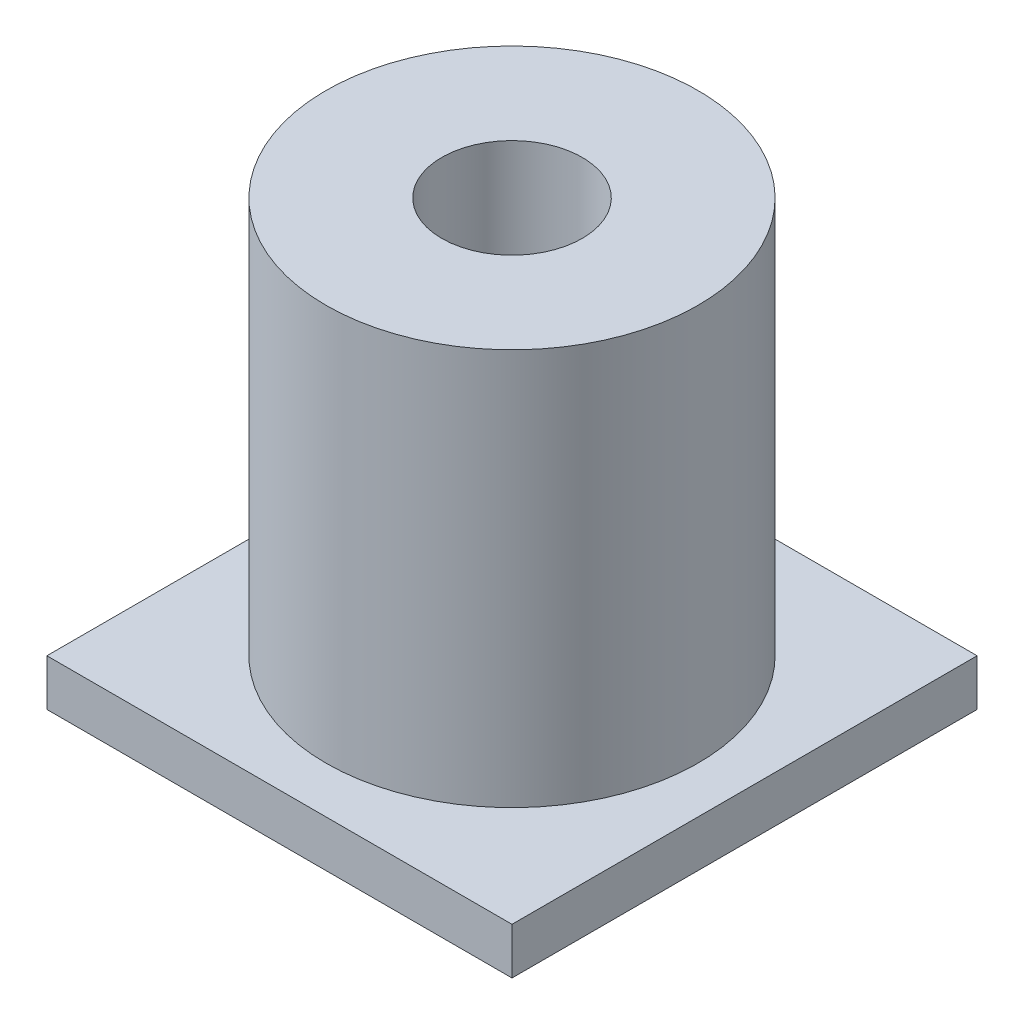
ISO-10303-21;
HEADER;
FILE_DESCRIPTION(('STEP AP214'),'2;1');
FILE_NAME('part.step','',(''),(''),'','','');
FILE_SCHEMA(('AUTOMOTIVE_DESIGN { 1 0 10303 214 1 1 1 1 }'));
ENDSEC;
DATA;
#1=APPLICATION_CONTEXT('core data for automotive mechanical design processes');
#2=APPLICATION_PROTOCOL_DEFINITION('international standard','automotive_design',2000,#1);
#3=PRODUCT_CONTEXT('',#1,'mechanical');
#4=PRODUCT('Part','Part','',(#3));
#5=PRODUCT_RELATED_PRODUCT_CATEGORY('part','',(#4));
#6=PRODUCT_DEFINITION_FORMATION('','',#4);
#7=PRODUCT_DEFINITION_CONTEXT('part definition',#1,'design');
#8=PRODUCT_DEFINITION('design','',#6,#7);
#9=PRODUCT_DEFINITION_SHAPE('','',#8);
#10=(LENGTH_UNIT() NAMED_UNIT(*) SI_UNIT(.MILLI.,.METRE.));
#11=(NAMED_UNIT(*) PLANE_ANGLE_UNIT() SI_UNIT($,.RADIAN.));
#12=(NAMED_UNIT(*) SI_UNIT($,.STERADIAN.) SOLID_ANGLE_UNIT());
#13=UNCERTAINTY_MEASURE_WITH_UNIT(LENGTH_MEASURE(1.E-05),#10,'distance_accuracy_value','');
#14=(GEOMETRIC_REPRESENTATION_CONTEXT(3) GLOBAL_UNCERTAINTY_ASSIGNED_CONTEXT((#13)) GLOBAL_UNIT_ASSIGNED_CONTEXT((#10,
#11,#12)) REPRESENTATION_CONTEXT('',''));
#15=CARTESIAN_POINT('',(0.,0.,0.));
#16=DIRECTION('',(0.,0.,1.));
#17=DIRECTION('',(1.,0.,0.));
#18=AXIS2_PLACEMENT_3D('',#15,#16,#17);
#19=CARTESIAN_POINT('',(0.,1.,0.));
#20=DIRECTION('',(0.,1.,0.));
#21=DIRECTION('',(0.,0.,1.));
#22=AXIS2_PLACEMENT_3D('',#19,#20,#21);
#23=PLANE('',#22);
#24=CARTESIAN_POINT('',(5.,1.,5.));
#25=DIRECTION('',(0.,1.,0.));
#26=DIRECTION('',(0.,0.,1.));
#27=AXIS2_PLACEMENT_3D('',#24,#25,#26);
#28=CIRCLE('',#27,1.25);
#29=CARTESIAN_POINT('',(5.,1.,6.25));
#30=VERTEX_POINT('',#29);
#31=EDGE_CURVE('E121',#30,#30,#28,.T.);
#32=ORIENTED_EDGE('',*,*,#31,.F.);
#33=EDGE_LOOP('',(#32));
#34=FACE_BOUND('',#33,.T.);
#35=CARTESIAN_POINT('',(5.,1.,5.));
#36=DIRECTION('',(0.,1.,0.));
#37=DIRECTION('',(0.,0.,1.));
#38=AXIS2_PLACEMENT_3D('',#35,#36,#37);
#39=CIRCLE('',#38,1.51);
#40=CARTESIAN_POINT('',(5.,1.,6.51));
#41=VERTEX_POINT('',#40);
#42=EDGE_CURVE('E151',#41,#41,#39,.T.);
#43=ORIENTED_EDGE('',*,*,#42,.T.);
#44=EDGE_LOOP('',(#43));
#45=FACE_BOUND('',#44,.T.);
#46=ADVANCED_FACE('F45',(#34,#45),#23,.T.);
#47=CARTESIAN_POINT('',(5.,1.,5.));
#48=DIRECTION('',(0.,1.,0.));
#49=DIRECTION('',(0.,0.,1.));
#50=AXIS2_PLACEMENT_3D('',#47,#48,#49);
#51=CIRCLE('',#50,4.);
#52=CARTESIAN_POINT('',(5.,1.,9.));
#53=VERTEX_POINT('',#52);
#54=EDGE_CURVE('E11',#53,#53,#51,.T.);
#55=ORIENTED_EDGE('',*,*,#54,.F.);
#56=EDGE_LOOP('',(#55));
#57=FACE_BOUND('',#56,.T.);
#58=DIRECTION('',(0.,0.,1.));
#59=VECTOR('',#58,1.);
#60=CARTESIAN_POINT('',(0.,1.,0.));
#61=LINE('',#60,#59);
#62=CARTESIAN_POINT('',(0.,1.,0.));
#63=VERTEX_POINT('',#62);
#64=CARTESIAN_POINT('',(0.,1.,10.));
#65=VERTEX_POINT('',#64);
#66=EDGE_CURVE('E100',#63,#65,#61,.T.);
#67=ORIENTED_EDGE('',*,*,#66,.T.);
#68=DIRECTION('',(1.,0.,0.));
#69=VECTOR('',#68,1.);
#70=CARTESIAN_POINT('',(0.,1.,10.));
#71=LINE('',#70,#69);
#72=CARTESIAN_POINT('',(10.,1.,10.));
#73=VERTEX_POINT('',#72);
#74=EDGE_CURVE('E95',#65,#73,#71,.T.);
#75=ORIENTED_EDGE('',*,*,#74,.T.);
#76=DIRECTION('',(0.,0.,-1.));
#77=VECTOR('',#76,1.);
#78=CARTESIAN_POINT('',(10.,1.,0.));
#79=LINE('',#78,#77);
#80=CARTESIAN_POINT('',(10.,1.,0.));
#81=VERTEX_POINT('',#80);
#82=EDGE_CURVE('E98',#73,#81,#79,.T.);
#83=ORIENTED_EDGE('',*,*,#82,.T.);
#84=DIRECTION('',(-1.,0.,0.));
#85=VECTOR('',#84,1.);
#86=CARTESIAN_POINT('',(0.,1.,0.));
#87=LINE('',#86,#85);
#88=EDGE_CURVE('E64',#81,#63,#87,.T.);
#89=ORIENTED_EDGE('',*,*,#88,.T.);
#90=EDGE_LOOP('',(#67,#75,#83,#89));
#91=FACE_BOUND('',#90,.T.);
#92=ADVANCED_FACE('F96',(#57,#91),#23,.T.);
#93=CARTESIAN_POINT('',(0.,0.,0.));
#94=DIRECTION('',(0.,1.,0.));
#95=DIRECTION('',(0.,0.,1.));
#96=AXIS2_PLACEMENT_3D('',#93,#94,#95);
#97=PLANE('',#96);
#98=DIRECTION('',(0.,0.,1.));
#99=VECTOR('',#98,1.);
#100=CARTESIAN_POINT('',(0.,0.,0.));
#101=LINE('',#100,#99);
#102=CARTESIAN_POINT('',(0.,0.,0.));
#103=VERTEX_POINT('',#102);
#104=CARTESIAN_POINT('',(0.,0.,10.));
#105=VERTEX_POINT('',#104);
#106=EDGE_CURVE('E117',#103,#105,#101,.T.);
#107=ORIENTED_EDGE('',*,*,#106,.F.);
#108=DIRECTION('',(-1.,0.,0.));
#109=VECTOR('',#108,1.);
#110=CARTESIAN_POINT('',(0.,0.,0.));
#111=LINE('',#110,#109);
#112=CARTESIAN_POINT('',(10.,0.,0.));
#113=VERTEX_POINT('',#112);
#114=EDGE_CURVE('E87',#113,#103,#111,.T.);
#115=ORIENTED_EDGE('',*,*,#114,.F.);
#116=DIRECTION('',(0.,0.,-1.));
#117=VECTOR('',#116,1.);
#118=CARTESIAN_POINT('',(10.,0.,0.));
#119=LINE('',#118,#117);
#120=CARTESIAN_POINT('',(10.,0.,10.));
#121=VERTEX_POINT('',#120);
#122=EDGE_CURVE('E81',#121,#113,#119,.T.);
#123=ORIENTED_EDGE('',*,*,#122,.F.);
#124=DIRECTION('',(1.,0.,0.));
#125=VECTOR('',#124,1.);
#126=CARTESIAN_POINT('',(0.,0.,10.));
#127=LINE('',#126,#125);
#128=EDGE_CURVE('E106',#105,#121,#127,.T.);
#129=ORIENTED_EDGE('',*,*,#128,.F.);
#130=EDGE_LOOP('',(#107,#115,#123,#129));
#131=FACE_BOUND('',#130,.T.);
#132=CARTESIAN_POINT('',(5.,0.,5.));
#133=DIRECTION('',(0.,1.,0.));
#134=DIRECTION('',(0.,0.,1.));
#135=AXIS2_PLACEMENT_3D('',#132,#133,#134);
#136=CIRCLE('',#135,1.25);
#137=CARTESIAN_POINT('',(5.,0.,6.25));
#138=VERTEX_POINT('',#137);
#139=EDGE_CURVE('E139',#138,#138,#136,.T.);
#140=ORIENTED_EDGE('',*,*,#139,.T.);
#141=EDGE_LOOP('',(#140));
#142=FACE_BOUND('',#141,.T.);
#143=ADVANCED_FACE('F134',(#131,#142),#97,.F.);
#144=CARTESIAN_POINT('',(0.,1.,0.));
#145=DIRECTION('',(1.,0.,0.));
#146=DIRECTION('',(0.,0.,-1.));
#147=AXIS2_PLACEMENT_3D('',#144,#145,#146);
#148=PLANE('',#147);
#149=ORIENTED_EDGE('',*,*,#106,.T.);
#150=DIRECTION('',(0.,-1.,0.));
#151=VECTOR('',#150,1.);
#152=CARTESIAN_POINT('',(0.,1.,10.));
#153=LINE('',#152,#151);
#154=EDGE_CURVE('E49',#65,#105,#153,.T.);
#155=ORIENTED_EDGE('',*,*,#154,.F.);
#156=ORIENTED_EDGE('',*,*,#66,.F.);
#157=DIRECTION('',(0.,-1.,0.));
#158=VECTOR('',#157,1.);
#159=CARTESIAN_POINT('',(0.,1.,0.));
#160=LINE('',#159,#158);
#161=EDGE_CURVE('E113',#63,#103,#160,.T.);
#162=ORIENTED_EDGE('',*,*,#161,.T.);
#163=EDGE_LOOP('',(#149,#155,#156,#162));
#164=FACE_BOUND('',#163,.T.);
#165=ADVANCED_FACE('F47',(#164),#148,.F.);
#166=CARTESIAN_POINT('',(0.,1.,10.));
#167=DIRECTION('',(0.,0.,-1.));
#168=DIRECTION('',(-1.,0.,0.));
#169=AXIS2_PLACEMENT_3D('',#166,#167,#168);
#170=PLANE('',#169);
#171=ORIENTED_EDGE('',*,*,#128,.T.);
#172=DIRECTION('',(0.,-1.,0.));
#173=VECTOR('',#172,1.);
#174=CARTESIAN_POINT('',(10.,1.,10.));
#175=LINE('',#174,#173);
#176=EDGE_CURVE('E104',#73,#121,#175,.T.);
#177=ORIENTED_EDGE('',*,*,#176,.F.);
#178=ORIENTED_EDGE('',*,*,#74,.F.);
#179=ORIENTED_EDGE('',*,*,#154,.T.);
#180=EDGE_LOOP('',(#171,#177,#178,#179));
#181=FACE_BOUND('',#180,.T.);
#182=ADVANCED_FACE('F105',(#181),#170,.F.);
#183=CARTESIAN_POINT('',(10.,1.,0.));
#184=DIRECTION('',(-1.,0.,0.));
#185=DIRECTION('',(0.,0.,1.));
#186=AXIS2_PLACEMENT_3D('',#183,#184,#185);
#187=PLANE('',#186);
#188=ORIENTED_EDGE('',*,*,#122,.T.);
#189=DIRECTION('',(0.,-1.,0.));
#190=VECTOR('',#189,1.);
#191=CARTESIAN_POINT('',(10.,1.,0.));
#192=LINE('',#191,#190);
#193=EDGE_CURVE('E108',#81,#113,#192,.T.);
#194=ORIENTED_EDGE('',*,*,#193,.F.);
#195=ORIENTED_EDGE('',*,*,#82,.F.);
#196=ORIENTED_EDGE('',*,*,#176,.T.);
#197=EDGE_LOOP('',(#188,#194,#195,#196));
#198=FACE_BOUND('',#197,.T.);
#199=ADVANCED_FACE('F109',(#198),#187,.F.);
#200=CARTESIAN_POINT('',(0.,1.,0.));
#201=DIRECTION('',(0.,0.,1.));
#202=DIRECTION('',(1.,0.,0.));
#203=AXIS2_PLACEMENT_3D('',#200,#201,#202);
#204=PLANE('',#203);
#205=ORIENTED_EDGE('',*,*,#114,.T.);
#206=ORIENTED_EDGE('',*,*,#161,.F.);
#207=ORIENTED_EDGE('',*,*,#88,.F.);
#208=ORIENTED_EDGE('',*,*,#193,.T.);
#209=EDGE_LOOP('',(#205,#206,#207,#208));
#210=FACE_BOUND('',#209,.T.);
#211=ADVANCED_FACE('F131',(#210),#204,.F.);
#212=CARTESIAN_POINT('',(5.,1.,5.));
#213=DIRECTION('',(0.,-1.,0.));
#214=DIRECTION('',(0.,0.,-1.));
#215=AXIS2_PLACEMENT_3D('',#212,#213,#214);
#216=CYLINDRICAL_SURFACE('',#215,1.25);
#217=ORIENTED_EDGE('',*,*,#31,.T.);
#218=EDGE_LOOP('',(#217));
#219=FACE_BOUND('',#218,.T.);
#220=ORIENTED_EDGE('',*,*,#139,.F.);
#221=EDGE_LOOP('',(#220));
#222=FACE_BOUND('',#221,.T.);
#223=ADVANCED_FACE('F165',(#219,#222),#216,.F.);
#224=CARTESIAN_POINT('',(5.,9.525,5.));
#225=DIRECTION('',(0.,1.,0.));
#226=DIRECTION('',(0.,0.,1.));
#227=AXIS2_PLACEMENT_3D('',#224,#225,#226);
#228=PLANE('',#227);
#229=CARTESIAN_POINT('',(5.,9.525,5.));
#230=DIRECTION('',(0.,1.,0.));
#231=DIRECTION('',(0.,0.,1.));
#232=AXIS2_PLACEMENT_3D('',#229,#230,#231);
#233=CIRCLE('',#232,4.);
#234=CARTESIAN_POINT('',(5.,9.525,9.));
#235=VERTEX_POINT('',#234);
#236=EDGE_CURVE('E143',#235,#235,#233,.T.);
#237=ORIENTED_EDGE('',*,*,#236,.T.);
#238=EDGE_LOOP('',(#237));
#239=FACE_BOUND('',#238,.T.);
#240=CARTESIAN_POINT('',(5.,9.525,5.));
#241=DIRECTION('',(0.,1.,0.));
#242=DIRECTION('',(0.,0.,1.));
#243=AXIS2_PLACEMENT_3D('',#240,#241,#242);
#244=CIRCLE('',#243,1.51);
#245=CARTESIAN_POINT('',(5.,9.525,6.51));
#246=VERTEX_POINT('',#245);
#247=EDGE_CURVE('E150',#246,#246,#244,.T.);
#248=ORIENTED_EDGE('',*,*,#247,.F.);
#249=EDGE_LOOP('',(#248));
#250=FACE_BOUND('',#249,.T.);
#251=ADVANCED_FACE('F162',(#239,#250),#228,.T.);
#252=CARTESIAN_POINT('',(5.,9.525,5.));
#253=DIRECTION('',(0.,-1.,0.));
#254=DIRECTION('',(0.,0.,-1.));
#255=AXIS2_PLACEMENT_3D('',#252,#253,#254);
#256=CYLINDRICAL_SURFACE('',#255,4.);
#257=ORIENTED_EDGE('',*,*,#236,.F.);
#258=EDGE_LOOP('',(#257));
#259=FACE_BOUND('',#258,.T.);
#260=ORIENTED_EDGE('',*,*,#54,.T.);
#261=EDGE_LOOP('',(#260));
#262=FACE_BOUND('',#261,.T.);
#263=ADVANCED_FACE('F164',(#259,#262),#256,.T.);
#264=CARTESIAN_POINT('',(5.,9.525,5.));
#265=DIRECTION('',(0.,-1.,0.));
#266=DIRECTION('',(0.,0.,-1.));
#267=AXIS2_PLACEMENT_3D('',#264,#265,#266);
#268=CYLINDRICAL_SURFACE('',#267,1.51);
#269=ORIENTED_EDGE('',*,*,#247,.T.);
#270=EDGE_LOOP('',(#269));
#271=FACE_BOUND('',#270,.T.);
#272=ORIENTED_EDGE('',*,*,#42,.F.);
#273=EDGE_LOOP('',(#272));
#274=FACE_BOUND('',#273,.T.);
#275=ADVANCED_FACE('F159',(#271,#274),#268,.F.);
#276=CLOSED_SHELL('',(#46,#92,#143,#165,#182,#199,#211,#223,#251,#263,#275));
#277=MANIFOLD_SOLID_BREP('B2',#276);
#278=ADVANCED_BREP_SHAPE_REPRESENTATION('',(#18,#277),#14);
#279=SHAPE_DEFINITION_REPRESENTATION(#9,#278);
ENDSEC;
END-ISO-10303-21;
